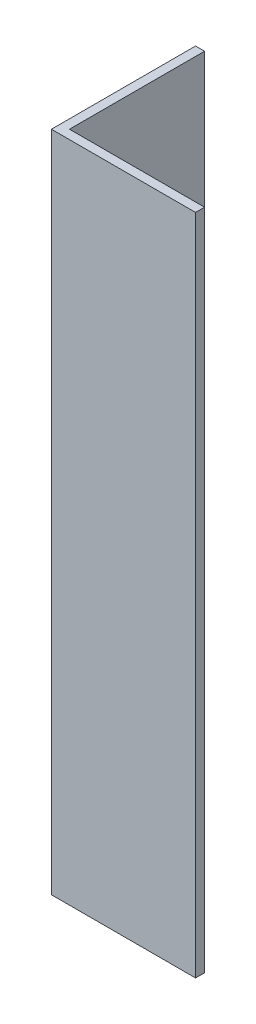
ISO-10303-21;
HEADER;
FILE_DESCRIPTION(('STEP AP214'),'2;1');
FILE_NAME('part.step','',(''),(''),'','','');
FILE_SCHEMA(('AUTOMOTIVE_DESIGN { 1 0 10303 214 1 1 1 1 }'));
ENDSEC;
DATA;
#1=APPLICATION_CONTEXT('core data for automotive mechanical design processes');
#2=APPLICATION_PROTOCOL_DEFINITION('international standard','automotive_design',2000,#1);
#3=PRODUCT_CONTEXT('',#1,'mechanical');
#4=PRODUCT('Part','Part','',(#3));
#5=PRODUCT_RELATED_PRODUCT_CATEGORY('part','',(#4));
#6=PRODUCT_DEFINITION_FORMATION('','',#4);
#7=PRODUCT_DEFINITION_CONTEXT('part definition',#1,'design');
#8=PRODUCT_DEFINITION('design','',#6,#7);
#9=PRODUCT_DEFINITION_SHAPE('','',#8);
#10=(LENGTH_UNIT() NAMED_UNIT(*) SI_UNIT(.MILLI.,.METRE.));
#11=(NAMED_UNIT(*) PLANE_ANGLE_UNIT() SI_UNIT($,.RADIAN.));
#12=(NAMED_UNIT(*) SI_UNIT($,.STERADIAN.) SOLID_ANGLE_UNIT());
#13=UNCERTAINTY_MEASURE_WITH_UNIT(LENGTH_MEASURE(1.E-05),#10,'distance_accuracy_value','');
#14=(GEOMETRIC_REPRESENTATION_CONTEXT(3) GLOBAL_UNCERTAINTY_ASSIGNED_CONTEXT((#13)) GLOBAL_UNIT_ASSIGNED_CONTEXT((#10,
#11,#12)) REPRESENTATION_CONTEXT('',''));
#15=CARTESIAN_POINT('',(0.,0.,0.));
#16=DIRECTION('',(0.,0.,1.));
#17=DIRECTION('',(1.,0.,0.));
#18=AXIS2_PLACEMENT_3D('',#15,#16,#17);
#19=CARTESIAN_POINT('',(0.,116.84,-25.4));
#20=DIRECTION('',(0.,0.,1.));
#21=DIRECTION('',(1.,0.,0.));
#22=AXIS2_PLACEMENT_3D('',#19,#20,#21);
#23=PLANE('',#22);
#24=DIRECTION('',(-1.,0.,0.));
#25=VECTOR('',#24,1.);
#26=CARTESIAN_POINT('',(0.,0.,-25.4));
#27=LINE('',#26,#25);
#28=CARTESIAN_POINT('',(1.5875,0.,-25.4));
#29=VERTEX_POINT('',#28);
#30=CARTESIAN_POINT('',(0.,0.,-25.4));
#31=VERTEX_POINT('',#30);
#32=EDGE_CURVE('E119',#29,#31,#27,.T.);
#33=ORIENTED_EDGE('',*,*,#32,.T.);
#34=DIRECTION('',(0.,-1.,0.));
#35=VECTOR('',#34,1.);
#36=CARTESIAN_POINT('',(0.,116.84,-25.4));
#37=LINE('',#36,#35);
#38=CARTESIAN_POINT('',(0.,116.84,-25.4));
#39=VERTEX_POINT('',#38);
#40=EDGE_CURVE('E11',#39,#31,#37,.T.);
#41=ORIENTED_EDGE('',*,*,#40,.F.);
#42=DIRECTION('',(-1.,0.,0.));
#43=VECTOR('',#42,1.);
#44=CARTESIAN_POINT('',(0.,116.84,-25.4));
#45=LINE('',#44,#43);
#46=CARTESIAN_POINT('',(1.5875,116.84,-25.4));
#47=VERTEX_POINT('',#46);
#48=EDGE_CURVE('E129',#47,#39,#45,.T.);
#49=ORIENTED_EDGE('',*,*,#48,.F.);
#50=DIRECTION('',(0.,-1.,0.));
#51=VECTOR('',#50,1.);
#52=CARTESIAN_POINT('',(1.5875,116.84,-25.4));
#53=LINE('',#52,#51);
#54=EDGE_CURVE('E115',#47,#29,#53,.T.);
#55=ORIENTED_EDGE('',*,*,#54,.T.);
#56=EDGE_LOOP('',(#33,#41,#49,#55));
#57=FACE_BOUND('',#56,.T.);
#58=ADVANCED_FACE('F35',(#57),#23,.F.);
#59=CARTESIAN_POINT('',(0.,116.84,0.));
#60=DIRECTION('',(1.,0.,0.));
#61=DIRECTION('',(0.,0.,-1.));
#62=AXIS2_PLACEMENT_3D('',#59,#60,#61);
#63=PLANE('',#62);
#64=DIRECTION('',(0.,0.,1.));
#65=VECTOR('',#64,1.);
#66=CARTESIAN_POINT('',(0.,0.,0.));
#67=LINE('',#66,#65);
#68=CARTESIAN_POINT('',(0.,0.,0.));
#69=VERTEX_POINT('',#68);
#70=EDGE_CURVE('E122',#31,#69,#67,.T.);
#71=ORIENTED_EDGE('',*,*,#70,.T.);
#72=DIRECTION('',(0.,-1.,0.));
#73=VECTOR('',#72,1.);
#74=CARTESIAN_POINT('',(0.,116.84,0.));
#75=LINE('',#74,#73);
#76=CARTESIAN_POINT('',(0.,116.84,0.));
#77=VERTEX_POINT('',#76);
#78=EDGE_CURVE('E43',#77,#69,#75,.T.);
#79=ORIENTED_EDGE('',*,*,#78,.F.);
#80=DIRECTION('',(0.,0.,1.));
#81=VECTOR('',#80,1.);
#82=CARTESIAN_POINT('',(0.,116.84,0.));
#83=LINE('',#82,#81);
#84=EDGE_CURVE('E88',#39,#77,#83,.T.);
#85=ORIENTED_EDGE('',*,*,#84,.F.);
#86=ORIENTED_EDGE('',*,*,#40,.T.);
#87=EDGE_LOOP('',(#71,#79,#85,#86));
#88=FACE_BOUND('',#87,.T.);
#89=ADVANCED_FACE('F153',(#88),#63,.F.);
#90=CARTESIAN_POINT('',(25.4,116.84,0.));
#91=DIRECTION('',(0.,0.,-1.));
#92=DIRECTION('',(-1.,0.,0.));
#93=AXIS2_PLACEMENT_3D('',#90,#91,#92);
#94=PLANE('',#93);
#95=DIRECTION('',(1.,0.,0.));
#96=VECTOR('',#95,1.);
#97=CARTESIAN_POINT('',(25.4,0.,0.));
#98=LINE('',#97,#96);
#99=CARTESIAN_POINT('',(25.4,0.,0.));
#100=VERTEX_POINT('',#99);
#101=EDGE_CURVE('E124',#69,#100,#98,.T.);
#102=ORIENTED_EDGE('',*,*,#101,.T.);
#103=DIRECTION('',(0.,-1.,0.));
#104=VECTOR('',#103,1.);
#105=CARTESIAN_POINT('',(25.4,116.84,0.));
#106=LINE('',#105,#104);
#107=CARTESIAN_POINT('',(25.4,116.84,0.));
#108=VERTEX_POINT('',#107);
#109=EDGE_CURVE('E110',#108,#100,#106,.T.);
#110=ORIENTED_EDGE('',*,*,#109,.F.);
#111=DIRECTION('',(1.,0.,0.));
#112=VECTOR('',#111,1.);
#113=CARTESIAN_POINT('',(25.4,116.84,0.));
#114=LINE('',#113,#112);
#115=EDGE_CURVE('E101',#77,#108,#114,.T.);
#116=ORIENTED_EDGE('',*,*,#115,.F.);
#117=ORIENTED_EDGE('',*,*,#78,.T.);
#118=EDGE_LOOP('',(#102,#110,#116,#117));
#119=FACE_BOUND('',#118,.T.);
#120=ADVANCED_FACE('F135',(#119),#94,.F.);
#121=CARTESIAN_POINT('',(25.4,116.84,-1.5875));
#122=DIRECTION('',(-1.,0.,0.));
#123=DIRECTION('',(0.,0.,1.));
#124=AXIS2_PLACEMENT_3D('',#121,#122,#123);
#125=PLANE('',#124);
#126=DIRECTION('',(0.,0.,-1.));
#127=VECTOR('',#126,1.);
#128=CARTESIAN_POINT('',(25.4,0.,-1.5875));
#129=LINE('',#128,#127);
#130=CARTESIAN_POINT('',(25.4,0.,-1.5875));
#131=VERTEX_POINT('',#130);
#132=EDGE_CURVE('E109',#100,#131,#129,.T.);
#133=ORIENTED_EDGE('',*,*,#132,.T.);
#134=DIRECTION('',(0.,-1.,0.));
#135=VECTOR('',#134,1.);
#136=CARTESIAN_POINT('',(25.4,116.84,-1.5875));
#137=LINE('',#136,#135);
#138=CARTESIAN_POINT('',(25.4,116.84,-1.5875));
#139=VERTEX_POINT('',#138);
#140=EDGE_CURVE('E106',#139,#131,#137,.T.);
#141=ORIENTED_EDGE('',*,*,#140,.F.);
#142=DIRECTION('',(0.,0.,-1.));
#143=VECTOR('',#142,1.);
#144=CARTESIAN_POINT('',(25.4,116.84,-1.5875));
#145=LINE('',#144,#143);
#146=EDGE_CURVE('E95',#108,#139,#145,.T.);
#147=ORIENTED_EDGE('',*,*,#146,.F.);
#148=ORIENTED_EDGE('',*,*,#109,.T.);
#149=EDGE_LOOP('',(#133,#141,#147,#148));
#150=FACE_BOUND('',#149,.T.);
#151=ADVANCED_FACE('F107',(#150),#125,.F.);
#152=CARTESIAN_POINT('',(1.5875,116.84,-1.5875));
#153=DIRECTION('',(0.,0.,1.));
#154=DIRECTION('',(1.,0.,0.));
#155=AXIS2_PLACEMENT_3D('',#152,#153,#154);
#156=PLANE('',#155);
#157=DIRECTION('',(-1.,0.,0.));
#158=VECTOR('',#157,1.);
#159=CARTESIAN_POINT('',(1.5875,0.,-1.5875));
#160=LINE('',#159,#158);
#161=CARTESIAN_POINT('',(1.5875,0.,-1.5875));
#162=VERTEX_POINT('',#161);
#163=EDGE_CURVE('E74',#131,#162,#160,.T.);
#164=ORIENTED_EDGE('',*,*,#163,.T.);
#165=DIRECTION('',(0.,-1.,0.));
#166=VECTOR('',#165,1.);
#167=CARTESIAN_POINT('',(1.5875,116.84,-1.5875));
#168=LINE('',#167,#166);
#169=CARTESIAN_POINT('',(1.5875,116.84,-1.5875));
#170=VERTEX_POINT('',#169);
#171=EDGE_CURVE('E111',#170,#162,#168,.T.);
#172=ORIENTED_EDGE('',*,*,#171,.F.);
#173=DIRECTION('',(-1.,0.,0.));
#174=VECTOR('',#173,1.);
#175=CARTESIAN_POINT('',(1.5875,116.84,-1.5875));
#176=LINE('',#175,#174);
#177=EDGE_CURVE('E99',#139,#170,#176,.T.);
#178=ORIENTED_EDGE('',*,*,#177,.F.);
#179=ORIENTED_EDGE('',*,*,#140,.T.);
#180=EDGE_LOOP('',(#164,#172,#178,#179));
#181=FACE_BOUND('',#180,.T.);
#182=ADVANCED_FACE('F113',(#181),#156,.F.);
#183=CARTESIAN_POINT('',(1.5875,116.84,-25.4));
#184=DIRECTION('',(-1.,0.,0.));
#185=DIRECTION('',(0.,0.,1.));
#186=AXIS2_PLACEMENT_3D('',#183,#184,#185);
#187=PLANE('',#186);
#188=DIRECTION('',(0.,0.,-1.));
#189=VECTOR('',#188,1.);
#190=CARTESIAN_POINT('',(1.5875,0.,-25.4));
#191=LINE('',#190,#189);
#192=EDGE_CURVE('E80',#162,#29,#191,.T.);
#193=ORIENTED_EDGE('',*,*,#192,.T.);
#194=ORIENTED_EDGE('',*,*,#54,.F.);
#195=DIRECTION('',(0.,0.,-1.));
#196=VECTOR('',#195,1.);
#197=CARTESIAN_POINT('',(1.5875,116.84,-25.4));
#198=LINE('',#197,#196);
#199=EDGE_CURVE('E51',#170,#47,#198,.T.);
#200=ORIENTED_EDGE('',*,*,#199,.F.);
#201=ORIENTED_EDGE('',*,*,#171,.T.);
#202=EDGE_LOOP('',(#193,#194,#200,#201));
#203=FACE_BOUND('',#202,.T.);
#204=ADVANCED_FACE('F142',(#203),#187,.F.);
#205=CARTESIAN_POINT('',(0.,116.84,0.));
#206=DIRECTION('',(0.,-1.,0.));
#207=DIRECTION('',(0.,0.,-1.));
#208=AXIS2_PLACEMENT_3D('',#205,#206,#207);
#209=PLANE('',#208);
#210=ORIENTED_EDGE('',*,*,#48,.T.);
#211=ORIENTED_EDGE('',*,*,#84,.T.);
#212=ORIENTED_EDGE('',*,*,#115,.T.);
#213=ORIENTED_EDGE('',*,*,#146,.T.);
#214=ORIENTED_EDGE('',*,*,#177,.T.);
#215=ORIENTED_EDGE('',*,*,#199,.T.);
#216=EDGE_LOOP('',(#210,#211,#212,#213,#214,#215));
#217=FACE_BOUND('',#216,.T.);
#218=ADVANCED_FACE('F97',(#217),#209,.F.);
#219=CARTESIAN_POINT('',(0.,0.,0.));
#220=DIRECTION('',(0.,-1.,0.));
#221=DIRECTION('',(0.,0.,-1.));
#222=AXIS2_PLACEMENT_3D('',#219,#220,#221);
#223=PLANE('',#222);
#224=ORIENTED_EDGE('',*,*,#32,.F.);
#225=ORIENTED_EDGE('',*,*,#192,.F.);
#226=ORIENTED_EDGE('',*,*,#163,.F.);
#227=ORIENTED_EDGE('',*,*,#132,.F.);
#228=ORIENTED_EDGE('',*,*,#101,.F.);
#229=ORIENTED_EDGE('',*,*,#70,.F.);
#230=EDGE_LOOP('',(#224,#225,#226,#227,#228,#229));
#231=FACE_BOUND('',#230,.T.);
#232=ADVANCED_FACE('F138',(#231),#223,.T.);
#233=CLOSED_SHELL('',(#58,#89,#120,#151,#182,#204,#218,#232));
#234=MANIFOLD_SOLID_BREP('B2',#233);
#235=ADVANCED_BREP_SHAPE_REPRESENTATION('',(#18,#234),#14);
#236=SHAPE_DEFINITION_REPRESENTATION(#9,#235);
ENDSEC;
END-ISO-10303-21;
